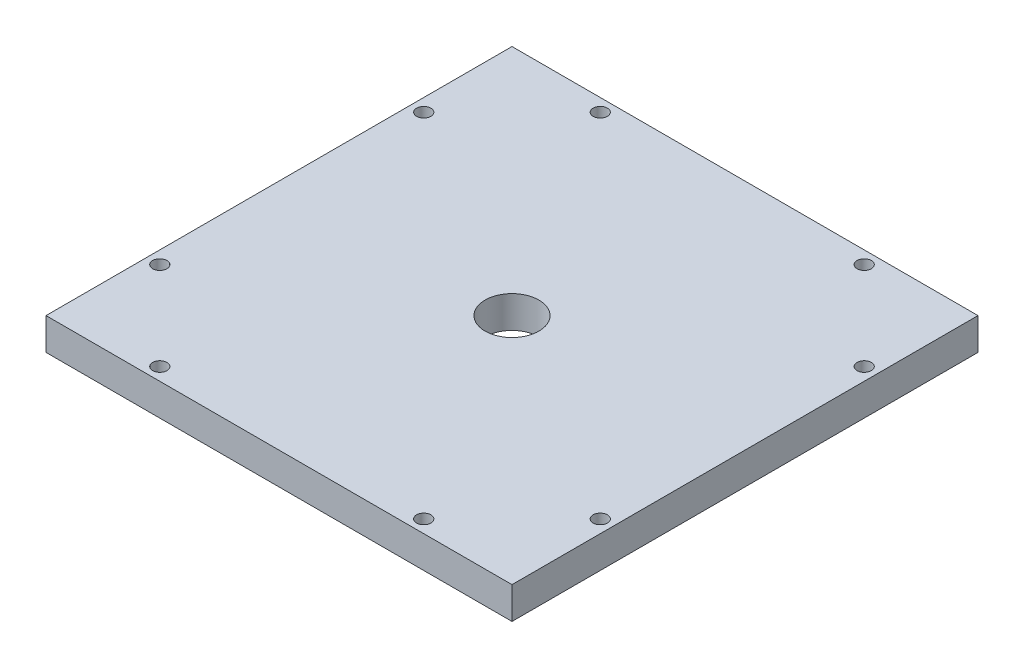
ISO-10303-21;
HEADER;
FILE_DESCRIPTION(('STEP AP214'),'2;1');
FILE_NAME('part.step','',(''),(''),'','','');
FILE_SCHEMA(('AUTOMOTIVE_DESIGN { 1 0 10303 214 1 1 1 1 }'));
ENDSEC;
DATA;
#1=APPLICATION_CONTEXT('core data for automotive mechanical design processes');
#2=APPLICATION_PROTOCOL_DEFINITION('international standard','automotive_design',2000,#1);
#3=PRODUCT_CONTEXT('',#1,'mechanical');
#4=PRODUCT('Part','Part','',(#3));
#5=PRODUCT_RELATED_PRODUCT_CATEGORY('part','',(#4));
#6=PRODUCT_DEFINITION_FORMATION('','',#4);
#7=PRODUCT_DEFINITION_CONTEXT('part definition',#1,'design');
#8=PRODUCT_DEFINITION('design','',#6,#7);
#9=PRODUCT_DEFINITION_SHAPE('','',#8);
#10=(LENGTH_UNIT() NAMED_UNIT(*) SI_UNIT(.MILLI.,.METRE.));
#11=(NAMED_UNIT(*) PLANE_ANGLE_UNIT() SI_UNIT($,.RADIAN.));
#12=(NAMED_UNIT(*) SI_UNIT($,.STERADIAN.) SOLID_ANGLE_UNIT());
#13=UNCERTAINTY_MEASURE_WITH_UNIT(LENGTH_MEASURE(1.E-05),#10,'distance_accuracy_value','');
#14=(GEOMETRIC_REPRESENTATION_CONTEXT(3) GLOBAL_UNCERTAINTY_ASSIGNED_CONTEXT((#13)) GLOBAL_UNIT_ASSIGNED_CONTEXT((#10,
#11,#12)) REPRESENTATION_CONTEXT('',''));
#15=CARTESIAN_POINT('',(0.,0.,0.));
#16=DIRECTION('',(0.,0.,1.));
#17=DIRECTION('',(1.,0.,0.));
#18=AXIS2_PLACEMENT_3D('',#15,#16,#17);
#19=CARTESIAN_POINT('',(0.,6.35,0.));
#20=DIRECTION('',(0.,-1.,0.));
#21=DIRECTION('',(0.,0.,-1.));
#22=AXIS2_PLACEMENT_3D('',#19,#20,#21);
#23=PLANE('',#22);
#24=CARTESIAN_POINT('',(72.609964,6.35,-2.54));
#25=DIRECTION('',(0.,-1.,0.));
#26=DIRECTION('',(0.,0.,1.));
#27=AXIS2_PLACEMENT_3D('',#24,#25,#26);
#28=CIRCLE('',#27,1.42240000000001);
#29=CARTESIAN_POINT('',(72.609964,6.35,-1.11759999999999));
#30=VERTEX_POINT('',#29);
#31=EDGE_CURVE('E159',#30,#30,#28,.T.);
#32=ORIENTED_EDGE('',*,*,#31,.T.);
#33=EDGE_LOOP('',(#32));
#34=FACE_BOUND('',#33,.T.);
#35=CARTESIAN_POINT('',(90.17,6.35,-20.100036));
#36=DIRECTION('',(0.,-1.,0.));
#37=DIRECTION('',(0.,0.,-1.));
#38=AXIS2_PLACEMENT_3D('',#35,#36,#37);
#39=CIRCLE('',#38,1.42240000000001);
#40=CARTESIAN_POINT('',(90.17,6.35,-21.522436));
#41=VERTEX_POINT('',#40);
#42=EDGE_CURVE('E153',#41,#41,#39,.T.);
#43=ORIENTED_EDGE('',*,*,#42,.T.);
#44=EDGE_LOOP('',(#43));
#45=FACE_BOUND('',#44,.T.);
#46=CARTESIAN_POINT('',(90.17,6.35,-72.609964));
#47=DIRECTION('',(0.,-1.,0.));
#48=DIRECTION('',(0.,0.,1.));
#49=AXIS2_PLACEMENT_3D('',#46,#47,#48);
#50=CIRCLE('',#49,1.42240000000001);
#51=CARTESIAN_POINT('',(90.17,6.35,-71.187564));
#52=VERTEX_POINT('',#51);
#53=EDGE_CURVE('E147',#52,#52,#50,.T.);
#54=ORIENTED_EDGE('',*,*,#53,.T.);
#55=EDGE_LOOP('',(#54));
#56=FACE_BOUND('',#55,.T.);
#57=CARTESIAN_POINT('',(72.609964,6.35,-90.17));
#58=DIRECTION('',(0.,-1.,0.));
#59=DIRECTION('',(0.,0.,-1.));
#60=AXIS2_PLACEMENT_3D('',#57,#58,#59);
#61=CIRCLE('',#60,1.42240000000001);
#62=CARTESIAN_POINT('',(72.609964,6.35,-91.5924));
#63=VERTEX_POINT('',#62);
#64=EDGE_CURVE('E141',#63,#63,#61,.T.);
#65=ORIENTED_EDGE('',*,*,#64,.T.);
#66=EDGE_LOOP('',(#65));
#67=FACE_BOUND('',#66,.T.);
#68=CARTESIAN_POINT('',(20.100036,6.35,-90.17));
#69=DIRECTION('',(0.,-1.,0.));
#70=DIRECTION('',(0.,0.,1.));
#71=AXIS2_PLACEMENT_3D('',#68,#69,#70);
#72=CIRCLE('',#71,1.4224);
#73=CARTESIAN_POINT('',(20.100036,6.35,-88.7476));
#74=VERTEX_POINT('',#73);
#75=EDGE_CURVE('E135',#74,#74,#72,.T.);
#76=ORIENTED_EDGE('',*,*,#75,.T.);
#77=EDGE_LOOP('',(#76));
#78=FACE_BOUND('',#77,.T.);
#79=CARTESIAN_POINT('',(2.54,6.35,-72.609964));
#80=DIRECTION('',(0.,-1.,0.));
#81=DIRECTION('',(0.,0.,-1.));
#82=AXIS2_PLACEMENT_3D('',#79,#80,#81);
#83=CIRCLE('',#82,1.4224);
#84=CARTESIAN_POINT('',(2.54,6.35,-74.032364));
#85=VERTEX_POINT('',#84);
#86=EDGE_CURVE('E129',#85,#85,#83,.T.);
#87=ORIENTED_EDGE('',*,*,#86,.T.);
#88=EDGE_LOOP('',(#87));
#89=FACE_BOUND('',#88,.T.);
#90=CARTESIAN_POINT('',(2.54,6.35,-20.100036));
#91=DIRECTION('',(0.,-1.,0.));
#92=DIRECTION('',(0.,0.,1.));
#93=AXIS2_PLACEMENT_3D('',#90,#91,#92);
#94=CIRCLE('',#93,1.4224);
#95=CARTESIAN_POINT('',(2.54,6.35,-18.677636));
#96=VERTEX_POINT('',#95);
#97=EDGE_CURVE('E123',#96,#96,#94,.T.);
#98=ORIENTED_EDGE('',*,*,#97,.T.);
#99=EDGE_LOOP('',(#98));
#100=FACE_BOUND('',#99,.T.);
#101=CARTESIAN_POINT('',(20.100036,6.35,-2.54));
#102=DIRECTION('',(0.,-1.,0.));
#103=DIRECTION('',(0.,0.,-1.));
#104=AXIS2_PLACEMENT_3D('',#101,#102,#103);
#105=CIRCLE('',#104,1.4224);
#106=CARTESIAN_POINT('',(20.100036,6.35,-3.9624));
#107=VERTEX_POINT('',#106);
#108=EDGE_CURVE('E117',#107,#107,#105,.T.);
#109=ORIENTED_EDGE('',*,*,#108,.T.);
#110=EDGE_LOOP('',(#109));
#111=FACE_BOUND('',#110,.T.);
#112=DIRECTION('',(0.,0.,1.));
#113=VECTOR('',#112,1.);
#114=CARTESIAN_POINT('',(0.,6.35,0.));
#115=LINE('',#114,#113);
#116=CARTESIAN_POINT('',(0.,6.35,-92.71));
#117=VERTEX_POINT('',#116);
#118=CARTESIAN_POINT('',(0.,6.35,0.));
#119=VERTEX_POINT('',#118);
#120=EDGE_CURVE('E87',#117,#119,#115,.T.);
#121=ORIENTED_EDGE('',*,*,#120,.T.);
#122=DIRECTION('',(1.,0.,0.));
#123=VECTOR('',#122,1.);
#124=CARTESIAN_POINT('',(0.,6.35,0.));
#125=LINE('',#124,#123);
#126=CARTESIAN_POINT('',(92.71,6.35,0.));
#127=VERTEX_POINT('',#126);
#128=EDGE_CURVE('E82',#119,#127,#125,.T.);
#129=ORIENTED_EDGE('',*,*,#128,.T.);
#130=DIRECTION('',(0.,0.,-1.));
#131=VECTOR('',#130,1.);
#132=CARTESIAN_POINT('',(92.71,6.35,0.));
#133=LINE('',#132,#131);
#134=CARTESIAN_POINT('',(92.71,6.35,-92.71));
#135=VERTEX_POINT('',#134);
#136=EDGE_CURVE('E85',#127,#135,#133,.T.);
#137=ORIENTED_EDGE('',*,*,#136,.T.);
#138=DIRECTION('',(-1.,0.,0.));
#139=VECTOR('',#138,1.);
#140=CARTESIAN_POINT('',(0.,6.35,-92.71));
#141=LINE('',#140,#139);
#142=EDGE_CURVE('E52',#135,#117,#141,.T.);
#143=ORIENTED_EDGE('',*,*,#142,.T.);
#144=EDGE_LOOP('',(#121,#129,#137,#143));
#145=FACE_BOUND('',#144,.T.);
#146=CARTESIAN_POINT('',(46.355,6.35,-46.355));
#147=DIRECTION('',(0.,1.,0.));
#148=DIRECTION('',(0.,0.,1.));
#149=AXIS2_PLACEMENT_3D('',#146,#147,#148);
#150=CIRCLE('',#149,5.3578125);
#151=CARTESIAN_POINT('',(46.355,6.35,-40.9971875));
#152=VERTEX_POINT('',#151);
#153=EDGE_CURVE('E102',#152,#152,#150,.T.);
#154=ORIENTED_EDGE('',*,*,#153,.F.);
#155=EDGE_LOOP('',(#154));
#156=FACE_BOUND('',#155,.T.);
#157=ADVANCED_FACE('F35',(#34,#45,#56,#67,#78,#89,#100,#111,#145,#156),#23,.F.);
#158=CARTESIAN_POINT('',(0.,0.,0.));
#159=DIRECTION('',(0.,-1.,0.));
#160=DIRECTION('',(0.,0.,-1.));
#161=AXIS2_PLACEMENT_3D('',#158,#159,#160);
#162=PLANE('',#161);
#163=CARTESIAN_POINT('',(72.609964,0.,-2.54));
#164=DIRECTION('',(0.,-1.,0.));
#165=DIRECTION('',(0.,0.,1.));
#166=AXIS2_PLACEMENT_3D('',#163,#164,#165);
#167=CIRCLE('',#166,1.42240000000001);
#168=CARTESIAN_POINT('',(72.609964,0.,-1.11759999999999));
#169=VERTEX_POINT('',#168);
#170=EDGE_CURVE('E162',#169,#169,#167,.T.);
#171=ORIENTED_EDGE('',*,*,#170,.F.);
#172=EDGE_LOOP('',(#171));
#173=FACE_BOUND('',#172,.T.);
#174=CARTESIAN_POINT('',(90.17,0.,-20.100036));
#175=DIRECTION('',(0.,-1.,0.));
#176=DIRECTION('',(0.,0.,-1.));
#177=AXIS2_PLACEMENT_3D('',#174,#175,#176);
#178=CIRCLE('',#177,1.42240000000001);
#179=CARTESIAN_POINT('',(90.17,0.,-21.522436));
#180=VERTEX_POINT('',#179);
#181=EDGE_CURVE('E156',#180,#180,#178,.T.);
#182=ORIENTED_EDGE('',*,*,#181,.F.);
#183=EDGE_LOOP('',(#182));
#184=FACE_BOUND('',#183,.T.);
#185=CARTESIAN_POINT('',(90.17,0.,-72.609964));
#186=DIRECTION('',(0.,-1.,0.));
#187=DIRECTION('',(0.,0.,1.));
#188=AXIS2_PLACEMENT_3D('',#185,#186,#187);
#189=CIRCLE('',#188,1.42240000000001);
#190=CARTESIAN_POINT('',(90.17,0.,-71.187564));
#191=VERTEX_POINT('',#190);
#192=EDGE_CURVE('E150',#191,#191,#189,.T.);
#193=ORIENTED_EDGE('',*,*,#192,.F.);
#194=EDGE_LOOP('',(#193));
#195=FACE_BOUND('',#194,.T.);
#196=CARTESIAN_POINT('',(72.609964,0.,-90.17));
#197=DIRECTION('',(0.,-1.,0.));
#198=DIRECTION('',(0.,0.,-1.));
#199=AXIS2_PLACEMENT_3D('',#196,#197,#198);
#200=CIRCLE('',#199,1.42240000000001);
#201=CARTESIAN_POINT('',(72.609964,0.,-91.5924));
#202=VERTEX_POINT('',#201);
#203=EDGE_CURVE('E144',#202,#202,#200,.T.);
#204=ORIENTED_EDGE('',*,*,#203,.F.);
#205=EDGE_LOOP('',(#204));
#206=FACE_BOUND('',#205,.T.);
#207=CARTESIAN_POINT('',(20.100036,0.,-90.17));
#208=DIRECTION('',(0.,-1.,0.));
#209=DIRECTION('',(0.,0.,1.));
#210=AXIS2_PLACEMENT_3D('',#207,#208,#209);
#211=CIRCLE('',#210,1.4224);
#212=CARTESIAN_POINT('',(20.100036,0.,-88.7476));
#213=VERTEX_POINT('',#212);
#214=EDGE_CURVE('E138',#213,#213,#211,.T.);
#215=ORIENTED_EDGE('',*,*,#214,.F.);
#216=EDGE_LOOP('',(#215));
#217=FACE_BOUND('',#216,.T.);
#218=CARTESIAN_POINT('',(2.54,0.,-72.609964));
#219=DIRECTION('',(0.,-1.,0.));
#220=DIRECTION('',(0.,0.,-1.));
#221=AXIS2_PLACEMENT_3D('',#218,#219,#220);
#222=CIRCLE('',#221,1.4224);
#223=CARTESIAN_POINT('',(2.54,0.,-74.032364));
#224=VERTEX_POINT('',#223);
#225=EDGE_CURVE('E132',#224,#224,#222,.T.);
#226=ORIENTED_EDGE('',*,*,#225,.F.);
#227=EDGE_LOOP('',(#226));
#228=FACE_BOUND('',#227,.T.);
#229=CARTESIAN_POINT('',(2.54,0.,-20.100036));
#230=DIRECTION('',(0.,-1.,0.));
#231=DIRECTION('',(0.,0.,1.));
#232=AXIS2_PLACEMENT_3D('',#229,#230,#231);
#233=CIRCLE('',#232,1.4224);
#234=CARTESIAN_POINT('',(2.54,0.,-18.677636));
#235=VERTEX_POINT('',#234);
#236=EDGE_CURVE('E126',#235,#235,#233,.T.);
#237=ORIENTED_EDGE('',*,*,#236,.F.);
#238=EDGE_LOOP('',(#237));
#239=FACE_BOUND('',#238,.T.);
#240=CARTESIAN_POINT('',(20.100036,0.,-2.54));
#241=DIRECTION('',(0.,-1.,0.));
#242=DIRECTION('',(0.,0.,-1.));
#243=AXIS2_PLACEMENT_3D('',#240,#241,#242);
#244=CIRCLE('',#243,1.4224);
#245=CARTESIAN_POINT('',(20.100036,0.,-3.9624));
#246=VERTEX_POINT('',#245);
#247=EDGE_CURVE('E120',#246,#246,#244,.T.);
#248=ORIENTED_EDGE('',*,*,#247,.F.);
#249=EDGE_LOOP('',(#248));
#250=FACE_BOUND('',#249,.T.);
#251=DIRECTION('',(0.,0.,1.));
#252=VECTOR('',#251,1.);
#253=CARTESIAN_POINT('',(0.,0.,0.));
#254=LINE('',#253,#252);
#255=CARTESIAN_POINT('',(0.,0.,-92.71));
#256=VERTEX_POINT('',#255);
#257=CARTESIAN_POINT('',(0.,0.,0.));
#258=VERTEX_POINT('',#257);
#259=EDGE_CURVE('E99',#256,#258,#254,.T.);
#260=ORIENTED_EDGE('',*,*,#259,.F.);
#261=DIRECTION('',(-1.,0.,0.));
#262=VECTOR('',#261,1.);
#263=CARTESIAN_POINT('',(0.,0.,-92.71));
#264=LINE('',#263,#262);
#265=CARTESIAN_POINT('',(92.71,0.,-92.71));
#266=VERTEX_POINT('',#265);
#267=EDGE_CURVE('E75',#266,#256,#264,.T.);
#268=ORIENTED_EDGE('',*,*,#267,.F.);
#269=DIRECTION('',(0.,0.,-1.));
#270=VECTOR('',#269,1.);
#271=CARTESIAN_POINT('',(92.71,0.,0.));
#272=LINE('',#271,#270);
#273=CARTESIAN_POINT('',(92.71,0.,0.));
#274=VERTEX_POINT('',#273);
#275=EDGE_CURVE('E69',#274,#266,#272,.T.);
#276=ORIENTED_EDGE('',*,*,#275,.F.);
#277=DIRECTION('',(1.,0.,0.));
#278=VECTOR('',#277,1.);
#279=CARTESIAN_POINT('',(0.,0.,0.));
#280=LINE('',#279,#278);
#281=EDGE_CURVE('E91',#258,#274,#280,.T.);
#282=ORIENTED_EDGE('',*,*,#281,.F.);
#283=EDGE_LOOP('',(#260,#268,#276,#282));
#284=FACE_BOUND('',#283,.T.);
#285=CARTESIAN_POINT('',(46.355,0.,-46.355));
#286=DIRECTION('',(0.,1.,0.));
#287=DIRECTION('',(0.,0.,1.));
#288=AXIS2_PLACEMENT_3D('',#285,#286,#287);
#289=CIRCLE('',#288,5.3578125);
#290=CARTESIAN_POINT('',(46.355,0.,-40.9971875));
#291=VERTEX_POINT('',#290);
#292=EDGE_CURVE('E114',#291,#291,#289,.T.);
#293=ORIENTED_EDGE('',*,*,#292,.T.);
#294=EDGE_LOOP('',(#293));
#295=FACE_BOUND('',#294,.T.);
#296=ADVANCED_FACE('F110',(#173,#184,#195,#206,#217,#228,#239,#250,#284,#295),#162,.T.);
#297=CARTESIAN_POINT('',(0.,6.35,0.));
#298=DIRECTION('',(1.,0.,0.));
#299=DIRECTION('',(0.,0.,-1.));
#300=AXIS2_PLACEMENT_3D('',#297,#298,#299);
#301=PLANE('',#300);
#302=ORIENTED_EDGE('',*,*,#259,.T.);
#303=DIRECTION('',(0.,-1.,0.));
#304=VECTOR('',#303,1.);
#305=CARTESIAN_POINT('',(0.,6.35,0.));
#306=LINE('',#305,#304);
#307=EDGE_CURVE('E11',#119,#258,#306,.T.);
#308=ORIENTED_EDGE('',*,*,#307,.F.);
#309=ORIENTED_EDGE('',*,*,#120,.F.);
#310=DIRECTION('',(0.,-1.,0.));
#311=VECTOR('',#310,1.);
#312=CARTESIAN_POINT('',(0.,6.35,-92.71));
#313=LINE('',#312,#311);
#314=EDGE_CURVE('E95',#117,#256,#313,.T.);
#315=ORIENTED_EDGE('',*,*,#314,.T.);
#316=EDGE_LOOP('',(#302,#308,#309,#315));
#317=FACE_BOUND('',#316,.T.);
#318=ADVANCED_FACE('F37',(#317),#301,.F.);
#319=CARTESIAN_POINT('',(0.,6.35,0.));
#320=DIRECTION('',(0.,0.,-1.));
#321=DIRECTION('',(-1.,0.,0.));
#322=AXIS2_PLACEMENT_3D('',#319,#320,#321);
#323=PLANE('',#322);
#324=ORIENTED_EDGE('',*,*,#281,.T.);
#325=DIRECTION('',(0.,-1.,0.));
#326=VECTOR('',#325,1.);
#327=CARTESIAN_POINT('',(92.71,6.35,0.));
#328=LINE('',#327,#326);
#329=EDGE_CURVE('E44',#127,#274,#328,.T.);
#330=ORIENTED_EDGE('',*,*,#329,.F.);
#331=ORIENTED_EDGE('',*,*,#128,.F.);
#332=ORIENTED_EDGE('',*,*,#307,.T.);
#333=EDGE_LOOP('',(#324,#330,#331,#332));
#334=FACE_BOUND('',#333,.T.);
#335=ADVANCED_FACE('F90',(#334),#323,.F.);
#336=CARTESIAN_POINT('',(92.71,6.35,0.));
#337=DIRECTION('',(-1.,0.,0.));
#338=DIRECTION('',(0.,0.,1.));
#339=AXIS2_PLACEMENT_3D('',#336,#337,#338);
#340=PLANE('',#339);
#341=ORIENTED_EDGE('',*,*,#275,.T.);
#342=DIRECTION('',(0.,-1.,0.));
#343=VECTOR('',#342,1.);
#344=CARTESIAN_POINT('',(92.71,6.35,-92.71));
#345=LINE('',#344,#343);
#346=EDGE_CURVE('E92',#135,#266,#345,.T.);
#347=ORIENTED_EDGE('',*,*,#346,.F.);
#348=ORIENTED_EDGE('',*,*,#136,.F.);
#349=ORIENTED_EDGE('',*,*,#329,.T.);
#350=EDGE_LOOP('',(#341,#347,#348,#349));
#351=FACE_BOUND('',#350,.T.);
#352=ADVANCED_FACE('F93',(#351),#340,.F.);
#353=CARTESIAN_POINT('',(0.,6.35,-92.71));
#354=DIRECTION('',(0.,0.,1.));
#355=DIRECTION('',(1.,0.,0.));
#356=AXIS2_PLACEMENT_3D('',#353,#354,#355);
#357=PLANE('',#356);
#358=ORIENTED_EDGE('',*,*,#267,.T.);
#359=ORIENTED_EDGE('',*,*,#314,.F.);
#360=ORIENTED_EDGE('',*,*,#142,.F.);
#361=ORIENTED_EDGE('',*,*,#346,.T.);
#362=EDGE_LOOP('',(#358,#359,#360,#361));
#363=FACE_BOUND('',#362,.T.);
#364=ADVANCED_FACE('F107',(#363),#357,.F.);
#365=CARTESIAN_POINT('',(46.355,6.35,-46.355));
#366=DIRECTION('',(0.,-1.,0.));
#367=DIRECTION('',(0.,0.,-1.));
#368=AXIS2_PLACEMENT_3D('',#365,#366,#367);
#369=CYLINDRICAL_SURFACE('',#368,5.3578125);
#370=ORIENTED_EDGE('',*,*,#153,.T.);
#371=EDGE_LOOP('',(#370));
#372=FACE_BOUND('',#371,.T.);
#373=ORIENTED_EDGE('',*,*,#292,.F.);
#374=EDGE_LOOP('',(#373));
#375=FACE_BOUND('',#374,.T.);
#376=ADVANCED_FACE('F197',(#372,#375),#369,.F.);
#377=CARTESIAN_POINT('',(20.100036,6.35,-2.54));
#378=DIRECTION('',(0.,-1.,0.));
#379=DIRECTION('',(0.,0.,-1.));
#380=AXIS2_PLACEMENT_3D('',#377,#378,#379);
#381=CYLINDRICAL_SURFACE('',#380,1.4224);
#382=ORIENTED_EDGE('',*,*,#108,.F.);
#383=EDGE_LOOP('',(#382));
#384=FACE_BOUND('',#383,.T.);
#385=ORIENTED_EDGE('',*,*,#247,.T.);
#386=EDGE_LOOP('',(#385));
#387=FACE_BOUND('',#386,.T.);
#388=ADVANCED_FACE('F194',(#384,#387),#381,.F.);
#389=CARTESIAN_POINT('',(2.54,6.35,-20.100036));
#390=DIRECTION('',(0.,-1.,0.));
#391=DIRECTION('',(0.,0.,-1.));
#392=AXIS2_PLACEMENT_3D('',#389,#390,#391);
#393=CYLINDRICAL_SURFACE('',#392,1.4224);
#394=ORIENTED_EDGE('',*,*,#97,.F.);
#395=EDGE_LOOP('',(#394));
#396=FACE_BOUND('',#395,.T.);
#397=ORIENTED_EDGE('',*,*,#236,.T.);
#398=EDGE_LOOP('',(#397));
#399=FACE_BOUND('',#398,.T.);
#400=ADVANCED_FACE('F196',(#396,#399),#393,.F.);
#401=CARTESIAN_POINT('',(2.54,6.35,-72.609964));
#402=DIRECTION('',(0.,-1.,0.));
#403=DIRECTION('',(0.,0.,-1.));
#404=AXIS2_PLACEMENT_3D('',#401,#402,#403);
#405=CYLINDRICAL_SURFACE('',#404,1.4224);
#406=ORIENTED_EDGE('',*,*,#86,.F.);
#407=EDGE_LOOP('',(#406));
#408=FACE_BOUND('',#407,.T.);
#409=ORIENTED_EDGE('',*,*,#225,.T.);
#410=EDGE_LOOP('',(#409));
#411=FACE_BOUND('',#410,.T.);
#412=ADVANCED_FACE('F204',(#408,#411),#405,.F.);
#413=CARTESIAN_POINT('',(20.100036,6.35,-90.17));
#414=DIRECTION('',(0.,-1.,0.));
#415=DIRECTION('',(0.,0.,-1.));
#416=AXIS2_PLACEMENT_3D('',#413,#414,#415);
#417=CYLINDRICAL_SURFACE('',#416,1.4224);
#418=ORIENTED_EDGE('',*,*,#75,.F.);
#419=EDGE_LOOP('',(#418));
#420=FACE_BOUND('',#419,.T.);
#421=ORIENTED_EDGE('',*,*,#214,.T.);
#422=EDGE_LOOP('',(#421));
#423=FACE_BOUND('',#422,.T.);
#424=ADVANCED_FACE('F251',(#420,#423),#417,.F.);
#425=CARTESIAN_POINT('',(72.609964,6.35,-90.17));
#426=DIRECTION('',(0.,-1.,0.));
#427=DIRECTION('',(0.,0.,-1.));
#428=AXIS2_PLACEMENT_3D('',#425,#426,#427);
#429=CYLINDRICAL_SURFACE('',#428,1.42240000000001);
#430=ORIENTED_EDGE('',*,*,#64,.F.);
#431=EDGE_LOOP('',(#430));
#432=FACE_BOUND('',#431,.T.);
#433=ORIENTED_EDGE('',*,*,#203,.T.);
#434=EDGE_LOOP('',(#433));
#435=FACE_BOUND('',#434,.T.);
#436=ADVANCED_FACE('F261',(#432,#435),#429,.F.);
#437=CARTESIAN_POINT('',(90.17,6.35,-72.609964));
#438=DIRECTION('',(0.,-1.,0.));
#439=DIRECTION('',(0.,0.,-1.));
#440=AXIS2_PLACEMENT_3D('',#437,#438,#439);
#441=CYLINDRICAL_SURFACE('',#440,1.42240000000001);
#442=ORIENTED_EDGE('',*,*,#53,.F.);
#443=EDGE_LOOP('',(#442));
#444=FACE_BOUND('',#443,.T.);
#445=ORIENTED_EDGE('',*,*,#192,.T.);
#446=EDGE_LOOP('',(#445));
#447=FACE_BOUND('',#446,.T.);
#448=ADVANCED_FACE('F271',(#444,#447),#441,.F.);
#449=CARTESIAN_POINT('',(90.17,6.35,-20.100036));
#450=DIRECTION('',(0.,-1.,0.));
#451=DIRECTION('',(0.,0.,-1.));
#452=AXIS2_PLACEMENT_3D('',#449,#450,#451);
#453=CYLINDRICAL_SURFACE('',#452,1.42240000000001);
#454=ORIENTED_EDGE('',*,*,#42,.F.);
#455=EDGE_LOOP('',(#454));
#456=FACE_BOUND('',#455,.T.);
#457=ORIENTED_EDGE('',*,*,#181,.T.);
#458=EDGE_LOOP('',(#457));
#459=FACE_BOUND('',#458,.T.);
#460=ADVANCED_FACE('F173',(#456,#459),#453,.F.);
#461=CARTESIAN_POINT('',(72.609964,6.35,-2.54));
#462=DIRECTION('',(0.,-1.,0.));
#463=DIRECTION('',(0.,0.,-1.));
#464=AXIS2_PLACEMENT_3D('',#461,#462,#463);
#465=CYLINDRICAL_SURFACE('',#464,1.42240000000001);
#466=ORIENTED_EDGE('',*,*,#31,.F.);
#467=EDGE_LOOP('',(#466));
#468=FACE_BOUND('',#467,.T.);
#469=ORIENTED_EDGE('',*,*,#170,.T.);
#470=EDGE_LOOP('',(#469));
#471=FACE_BOUND('',#470,.T.);
#472=ADVANCED_FACE('F170',(#468,#471),#465,.F.);
#473=CLOSED_SHELL('',(#157,#296,#318,#335,#352,#364,#376,#388,#400,#412,#424,#436,#448,#460,#472));
#474=MANIFOLD_SOLID_BREP('B2',#473);
#475=ADVANCED_BREP_SHAPE_REPRESENTATION('',(#18,#474),#14);
#476=SHAPE_DEFINITION_REPRESENTATION(#9,#475);
ENDSEC;
END-ISO-10303-21;
